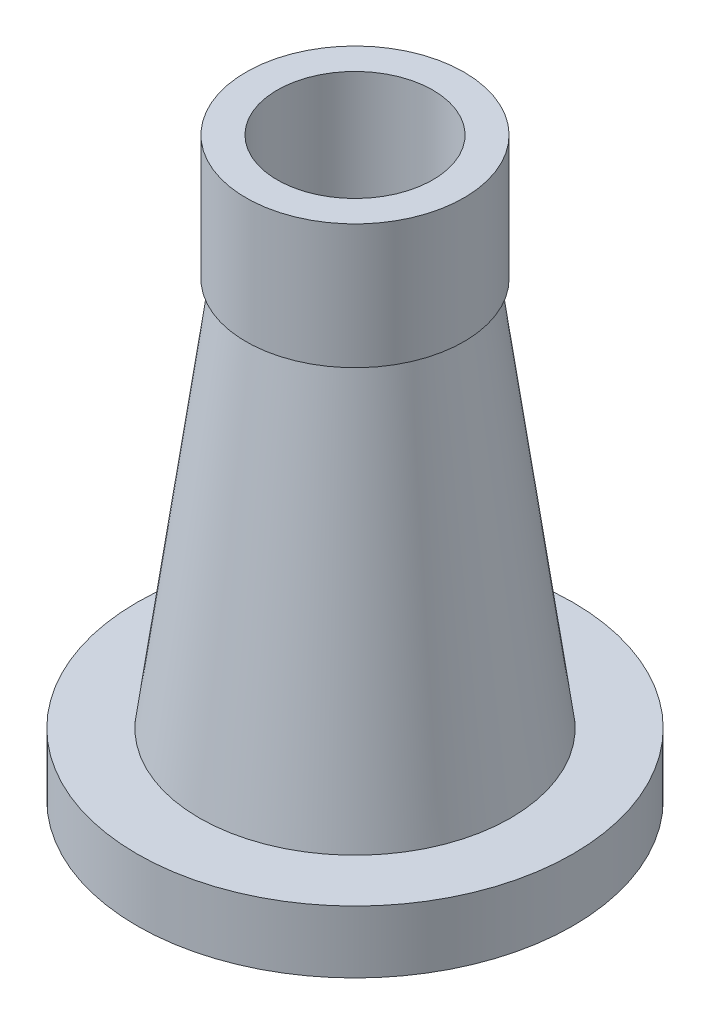
ISO-10303-21;
HEADER;
FILE_DESCRIPTION(('STEP AP214'),'2;1');
FILE_NAME('part.step','',(''),(''),'','','');
FILE_SCHEMA(('AUTOMOTIVE_DESIGN { 1 0 10303 214 1 1 1 1 }'));
ENDSEC;
DATA;
#1=APPLICATION_CONTEXT('core data for automotive mechanical design processes');
#2=APPLICATION_PROTOCOL_DEFINITION('international standard','automotive_design',2000,#1);
#3=PRODUCT_CONTEXT('',#1,'mechanical');
#4=PRODUCT('Part','Part','',(#3));
#5=PRODUCT_RELATED_PRODUCT_CATEGORY('part','',(#4));
#6=PRODUCT_DEFINITION_FORMATION('','',#4);
#7=PRODUCT_DEFINITION_CONTEXT('part definition',#1,'design');
#8=PRODUCT_DEFINITION('design','',#6,#7);
#9=PRODUCT_DEFINITION_SHAPE('','',#8);
#10=(LENGTH_UNIT() NAMED_UNIT(*) SI_UNIT(.MILLI.,.METRE.));
#11=(NAMED_UNIT(*) PLANE_ANGLE_UNIT() SI_UNIT($,.RADIAN.));
#12=(NAMED_UNIT(*) SI_UNIT($,.STERADIAN.) SOLID_ANGLE_UNIT());
#13=UNCERTAINTY_MEASURE_WITH_UNIT(LENGTH_MEASURE(1.E-05),#10,'distance_accuracy_value','');
#14=(GEOMETRIC_REPRESENTATION_CONTEXT(3) GLOBAL_UNCERTAINTY_ASSIGNED_CONTEXT((#13)) GLOBAL_UNIT_ASSIGNED_CONTEXT((#10,
#11,#12)) REPRESENTATION_CONTEXT('',''));
#15=CARTESIAN_POINT('',(0.,0.,0.));
#16=DIRECTION('',(0.,0.,1.));
#17=DIRECTION('',(1.,0.,0.));
#18=AXIS2_PLACEMENT_3D('',#15,#16,#17);
#19=CARTESIAN_POINT('',(50.,0.,0.));
#20=DIRECTION('',(0.,-1.,0.));
#21=DIRECTION('',(0.,0.,-1.));
#22=AXIS2_PLACEMENT_3D('',#19,#20,#21);
#23=PLANE('',#22);
#24=CARTESIAN_POINT('',(0.,0.,0.));
#25=DIRECTION('',(0.,-1.,0.));
#26=DIRECTION('',(0.,0.,-1.));
#27=AXIS2_PLACEMENT_3D('',#24,#25,#26);
#28=CIRCLE('',#27,70.0000000000001);
#29=CARTESIAN_POINT('',(0.,0.,-70.0000000000001));
#30=VERTEX_POINT('',#29);
#31=EDGE_CURVE('E10',#30,#30,#28,.T.);
#32=ORIENTED_EDGE('',*,*,#31,.T.);
#33=EDGE_LOOP('',(#32));
#34=FACE_BOUND('',#33,.T.);
#35=CARTESIAN_POINT('',(0.,0.,0.));
#36=DIRECTION('',(0.,-1.,0.));
#37=DIRECTION('',(0.,0.,-1.));
#38=AXIS2_PLACEMENT_3D('',#35,#36,#37);
#39=CIRCLE('',#38,50.);
#40=CARTESIAN_POINT('',(0.,0.,-50.));
#41=VERTEX_POINT('',#40);
#42=EDGE_CURVE('E68',#41,#41,#39,.T.);
#43=ORIENTED_EDGE('',*,*,#42,.F.);
#44=EDGE_LOOP('',(#43));
#45=FACE_BOUND('',#44,.T.);
#46=ADVANCED_FACE('F31',(#34,#45),#23,.T.);
#47=CARTESIAN_POINT('',(0.,0.,0.));
#48=DIRECTION('',(0.,-1.,0.));
#49=DIRECTION('',(0.,0.,-1.));
#50=AXIS2_PLACEMENT_3D('',#47,#48,#49);
#51=CYLINDRICAL_SURFACE('',#50,70.0000000000001);
#52=CARTESIAN_POINT('',(0.,20.,0.));
#53=DIRECTION('',(0.,-1.,0.));
#54=DIRECTION('',(0.,0.,-1.));
#55=AXIS2_PLACEMENT_3D('',#52,#53,#54);
#56=CIRCLE('',#55,70.0000000000001);
#57=CARTESIAN_POINT('',(0.,20.,-70.0000000000001));
#58=VERTEX_POINT('',#57);
#59=EDGE_CURVE('E37',#58,#58,#56,.T.);
#60=ORIENTED_EDGE('',*,*,#59,.T.);
#61=EDGE_LOOP('',(#60));
#62=FACE_BOUND('',#61,.T.);
#63=ORIENTED_EDGE('',*,*,#31,.F.);
#64=EDGE_LOOP('',(#63));
#65=FACE_BOUND('',#64,.T.);
#66=ADVANCED_FACE('F76',(#62,#65),#51,.T.);
#67=CARTESIAN_POINT('',(70.0000000000001,20.,0.));
#68=DIRECTION('',(0.,1.,0.));
#69=DIRECTION('',(0.,0.,1.));
#70=AXIS2_PLACEMENT_3D('',#67,#68,#69);
#71=PLANE('',#70);
#72=CARTESIAN_POINT('',(0.,20.,0.));
#73=DIRECTION('',(0.,-1.,0.));
#74=DIRECTION('',(0.,0.,-1.));
#75=AXIS2_PLACEMENT_3D('',#72,#73,#74);
#76=CIRCLE('',#75,50.);
#77=CARTESIAN_POINT('',(0.,20.,-50.));
#78=VERTEX_POINT('',#77);
#79=EDGE_CURVE('E41',#78,#78,#76,.T.);
#80=ORIENTED_EDGE('',*,*,#79,.T.);
#81=EDGE_LOOP('',(#80));
#82=FACE_BOUND('',#81,.T.);
#83=ORIENTED_EDGE('',*,*,#59,.F.);
#84=EDGE_LOOP('',(#83));
#85=FACE_BOUND('',#84,.T.);
#86=ADVANCED_FACE('F80',(#82,#85),#71,.T.);
#87=CARTESIAN_POINT('',(0.,20.,0.));
#88=DIRECTION('',(0.,-1.,0.));
#89=DIRECTION('',(0.,0.,-1.));
#90=AXIS2_PLACEMENT_3D('',#87,#88,#89);
#91=CONICAL_SURFACE('',#90,50.,0.135170698649009);
#92=CARTESIAN_POINT('',(0.,145.,0.));
#93=DIRECTION('',(0.,-1.,0.));
#94=DIRECTION('',(0.,0.,-1.));
#95=AXIS2_PLACEMENT_3D('',#92,#93,#94);
#96=CIRCLE('',#95,33.);
#97=CARTESIAN_POINT('',(0.,145.,-33.));
#98=VERTEX_POINT('',#97);
#99=EDGE_CURVE('E45',#98,#98,#96,.T.);
#100=ORIENTED_EDGE('',*,*,#99,.T.);
#101=EDGE_LOOP('',(#100));
#102=FACE_BOUND('',#101,.T.);
#103=ORIENTED_EDGE('',*,*,#79,.F.);
#104=EDGE_LOOP('',(#103));
#105=FACE_BOUND('',#104,.T.);
#106=ADVANCED_FACE('F84',(#102,#105),#91,.T.);
#107=CARTESIAN_POINT('',(33.,145.,0.));
#108=DIRECTION('',(0.,-1.,0.));
#109=DIRECTION('',(0.,0.,-1.));
#110=AXIS2_PLACEMENT_3D('',#107,#108,#109);
#111=PLANE('',#110);
#112=CARTESIAN_POINT('',(0.,145.,0.));
#113=DIRECTION('',(0.,-1.,0.));
#114=DIRECTION('',(0.,0.,-1.));
#115=AXIS2_PLACEMENT_3D('',#112,#113,#114);
#116=CIRCLE('',#115,35.);
#117=CARTESIAN_POINT('',(0.,145.,-35.));
#118=VERTEX_POINT('',#117);
#119=EDGE_CURVE('E50',#118,#118,#116,.T.);
#120=ORIENTED_EDGE('',*,*,#119,.T.);
#121=EDGE_LOOP('',(#120));
#122=FACE_BOUND('',#121,.T.);
#123=ORIENTED_EDGE('',*,*,#99,.F.);
#124=EDGE_LOOP('',(#123));
#125=FACE_BOUND('',#124,.T.);
#126=ADVANCED_FACE('F91',(#122,#125),#111,.T.);
#127=CARTESIAN_POINT('',(0.,0.,0.));
#128=DIRECTION('',(0.,-1.,0.));
#129=DIRECTION('',(0.,0.,-1.));
#130=AXIS2_PLACEMENT_3D('',#127,#128,#129);
#131=CYLINDRICAL_SURFACE('',#130,35.);
#132=CARTESIAN_POINT('',(0.,185.,0.));
#133=DIRECTION('',(0.,-1.,0.));
#134=DIRECTION('',(0.,0.,-1.));
#135=AXIS2_PLACEMENT_3D('',#132,#133,#134);
#136=CIRCLE('',#135,35.);
#137=CARTESIAN_POINT('',(0.,185.,-35.));
#138=VERTEX_POINT('',#137);
#139=EDGE_CURVE('E53',#138,#138,#136,.T.);
#140=ORIENTED_EDGE('',*,*,#139,.T.);
#141=EDGE_LOOP('',(#140));
#142=FACE_BOUND('',#141,.T.);
#143=ORIENTED_EDGE('',*,*,#119,.F.);
#144=EDGE_LOOP('',(#143));
#145=FACE_BOUND('',#144,.T.);
#146=ADVANCED_FACE('F95',(#142,#145),#131,.T.);
#147=CARTESIAN_POINT('',(35.,185.,0.));
#148=DIRECTION('',(0.,1.,0.));
#149=DIRECTION('',(0.,0.,1.));
#150=AXIS2_PLACEMENT_3D('',#147,#148,#149);
#151=PLANE('',#150);
#152=CARTESIAN_POINT('',(0.,185.,0.));
#153=DIRECTION('',(0.,-1.,0.));
#154=DIRECTION('',(0.,0.,-1.));
#155=AXIS2_PLACEMENT_3D('',#152,#153,#154);
#156=CIRCLE('',#155,25.);
#157=CARTESIAN_POINT('',(0.,185.,-25.));
#158=VERTEX_POINT('',#157);
#159=EDGE_CURVE('E56',#158,#158,#156,.T.);
#160=ORIENTED_EDGE('',*,*,#159,.T.);
#161=EDGE_LOOP('',(#160));
#162=FACE_BOUND('',#161,.T.);
#163=ORIENTED_EDGE('',*,*,#139,.F.);
#164=EDGE_LOOP('',(#163));
#165=FACE_BOUND('',#164,.T.);
#166=ADVANCED_FACE('F99',(#162,#165),#151,.T.);
#167=CARTESIAN_POINT('',(0.,0.,0.));
#168=DIRECTION('',(0.,-1.,0.));
#169=DIRECTION('',(0.,0.,-1.));
#170=AXIS2_PLACEMENT_3D('',#167,#168,#169);
#171=CYLINDRICAL_SURFACE('',#170,25.);
#172=CARTESIAN_POINT('',(0.,129.617233220244,0.));
#173=DIRECTION('',(0.,-1.,0.));
#174=DIRECTION('',(0.,0.,-1.));
#175=AXIS2_PLACEMENT_3D('',#172,#173,#174);
#176=CIRCLE('',#175,25.);
#177=CARTESIAN_POINT('',(0.,129.617233220244,-25.));
#178=VERTEX_POINT('',#177);
#179=EDGE_CURVE('E59',#178,#178,#176,.T.);
#180=ORIENTED_EDGE('',*,*,#179,.T.);
#181=EDGE_LOOP('',(#180));
#182=FACE_BOUND('',#181,.T.);
#183=ORIENTED_EDGE('',*,*,#159,.F.);
#184=EDGE_LOOP('',(#183));
#185=FACE_BOUND('',#184,.T.);
#186=ADVANCED_FACE('F103',(#182,#185),#171,.F.);
#187=CARTESIAN_POINT('',(0.,129.617233220244,0.));
#188=DIRECTION('',(0.,-1.,0.));
#189=DIRECTION('',(0.,0.,-1.));
#190=AXIS2_PLACEMENT_3D('',#187,#188,#189);
#191=CONICAL_SURFACE('',#190,25.,0.135170698649009);
#192=CARTESIAN_POINT('',(0.,3.,0.));
#193=DIRECTION('',(0.,-1.,0.));
#194=DIRECTION('',(0.,0.,-1.));
#195=AXIS2_PLACEMENT_3D('',#192,#193,#194);
#196=CIRCLE('',#195,42.2199437179532);
#197=CARTESIAN_POINT('',(0.,3.,-42.2199437179532));
#198=VERTEX_POINT('',#197);
#199=EDGE_CURVE('E62',#198,#198,#196,.T.);
#200=ORIENTED_EDGE('',*,*,#199,.T.);
#201=EDGE_LOOP('',(#200));
#202=FACE_BOUND('',#201,.T.);
#203=ORIENTED_EDGE('',*,*,#179,.F.);
#204=EDGE_LOOP('',(#203));
#205=FACE_BOUND('',#204,.T.);
#206=ADVANCED_FACE('F107',(#202,#205),#191,.F.);
#207=CARTESIAN_POINT('',(42.2199437179532,3.,0.));
#208=DIRECTION('',(0.,-1.,0.));
#209=DIRECTION('',(0.,0.,-1.));
#210=AXIS2_PLACEMENT_3D('',#207,#208,#209);
#211=PLANE('',#210);
#212=CARTESIAN_POINT('',(0.,3.,0.));
#213=DIRECTION('',(0.,-1.,0.));
#214=DIRECTION('',(0.,0.,-1.));
#215=AXIS2_PLACEMENT_3D('',#212,#213,#214);
#216=CIRCLE('',#215,50.);
#217=CARTESIAN_POINT('',(0.,3.,-50.));
#218=VERTEX_POINT('',#217);
#219=EDGE_CURVE('E65',#218,#218,#216,.T.);
#220=ORIENTED_EDGE('',*,*,#219,.T.);
#221=EDGE_LOOP('',(#220));
#222=FACE_BOUND('',#221,.T.);
#223=ORIENTED_EDGE('',*,*,#199,.F.);
#224=EDGE_LOOP('',(#223));
#225=FACE_BOUND('',#224,.T.);
#226=ADVANCED_FACE('F111',(#222,#225),#211,.T.);
#227=CARTESIAN_POINT('',(0.,0.,0.));
#228=DIRECTION('',(0.,-1.,0.));
#229=DIRECTION('',(0.,0.,-1.));
#230=AXIS2_PLACEMENT_3D('',#227,#228,#229);
#231=CYLINDRICAL_SURFACE('',#230,50.);
#232=ORIENTED_EDGE('',*,*,#42,.T.);
#233=EDGE_LOOP('',(#232));
#234=FACE_BOUND('',#233,.T.);
#235=ORIENTED_EDGE('',*,*,#219,.F.);
#236=EDGE_LOOP('',(#235));
#237=FACE_BOUND('',#236,.T.);
#238=ADVANCED_FACE('F72',(#234,#237),#231,.F.);
#239=CLOSED_SHELL('',(#46,#66,#86,#106,#126,#146,#166,#186,#206,#226,#238));
#240=MANIFOLD_SOLID_BREP('B2',#239);
#241=ADVANCED_BREP_SHAPE_REPRESENTATION('',(#18,#240),#14);
#242=SHAPE_DEFINITION_REPRESENTATION(#9,#241);
ENDSEC;
END-ISO-10303-21;
